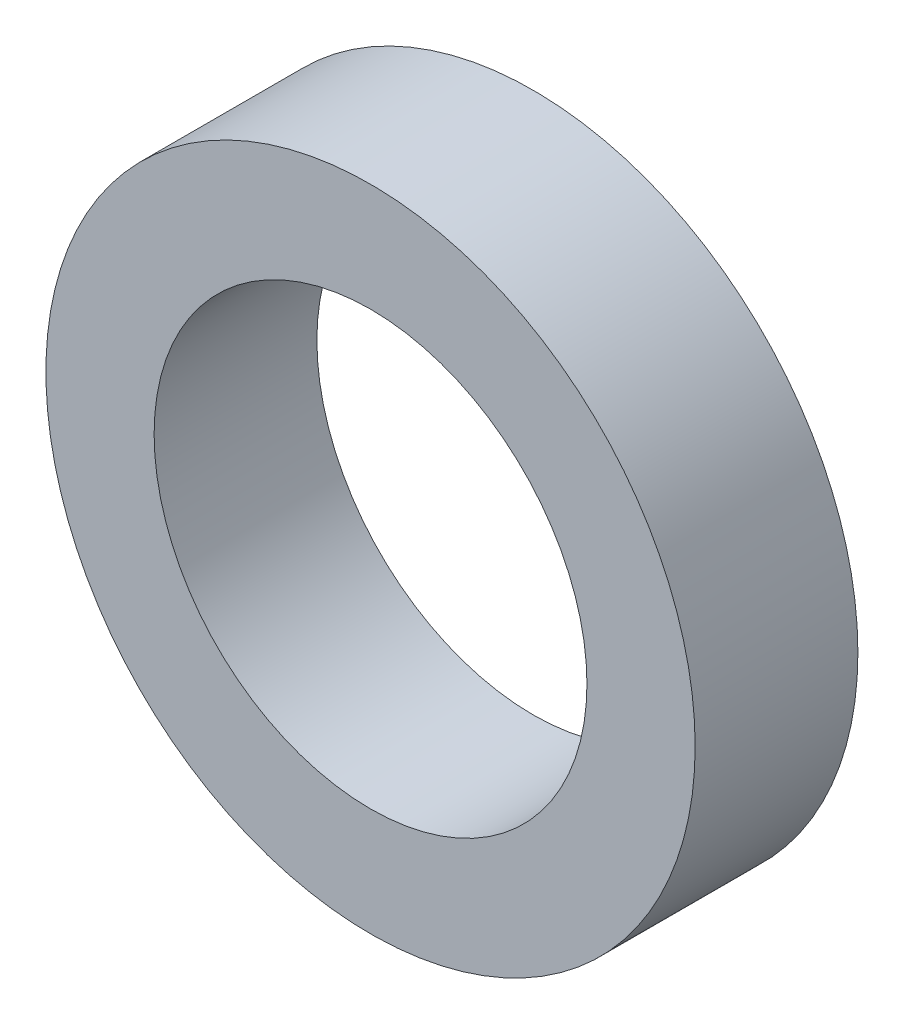
ISO-10303-21;
HEADER;
FILE_DESCRIPTION(('STEP AP214'),'2;1');
FILE_NAME('part.step','',(''),(''),'','','');
FILE_SCHEMA(('AUTOMOTIVE_DESIGN { 1 0 10303 214 1 1 1 1 }'));
ENDSEC;
DATA;
#1=APPLICATION_CONTEXT('core data for automotive mechanical design processes');
#2=APPLICATION_PROTOCOL_DEFINITION('international standard','automotive_design',2000,#1);
#3=PRODUCT_CONTEXT('',#1,'mechanical');
#4=PRODUCT('Part','Part','',(#3));
#5=PRODUCT_RELATED_PRODUCT_CATEGORY('part','',(#4));
#6=PRODUCT_DEFINITION_FORMATION('','',#4);
#7=PRODUCT_DEFINITION_CONTEXT('part definition',#1,'design');
#8=PRODUCT_DEFINITION('design','',#6,#7);
#9=PRODUCT_DEFINITION_SHAPE('','',#8);
#10=(LENGTH_UNIT() NAMED_UNIT(*) SI_UNIT(.MILLI.,.METRE.));
#11=(NAMED_UNIT(*) PLANE_ANGLE_UNIT() SI_UNIT($,.RADIAN.));
#12=(NAMED_UNIT(*) SI_UNIT($,.STERADIAN.) SOLID_ANGLE_UNIT());
#13=UNCERTAINTY_MEASURE_WITH_UNIT(LENGTH_MEASURE(1.E-05),#10,'distance_accuracy_value','');
#14=(GEOMETRIC_REPRESENTATION_CONTEXT(3) GLOBAL_UNCERTAINTY_ASSIGNED_CONTEXT((#13)) GLOBAL_UNIT_ASSIGNED_CONTEXT((#10,
#11,#12)) REPRESENTATION_CONTEXT('',''));
#15=CARTESIAN_POINT('',(0.,0.,0.));
#16=DIRECTION('',(0.,0.,1.));
#17=DIRECTION('',(1.,0.,0.));
#18=AXIS2_PLACEMENT_3D('',#15,#16,#17);
#19=CARTESIAN_POINT('',(6.35000000000001,0.,0.));
#20=DIRECTION('',(0.,0.,1.));
#21=DIRECTION('',(1.,0.,0.));
#22=AXIS2_PLACEMENT_3D('',#19,#20,#21);
#23=PLANE('',#22);
#24=CARTESIAN_POINT('',(0.,0.,0.));
#25=DIRECTION('',(0.,0.,1.));
#26=DIRECTION('',(1.,0.,0.));
#27=AXIS2_PLACEMENT_3D('',#24,#25,#26);
#28=CIRCLE('',#27,6.35);
#29=CARTESIAN_POINT('',(6.35,0.,0.));
#30=VERTEX_POINT('',#29);
#31=EDGE_CURVE('E18',#30,#30,#28,.F.);
#32=ORIENTED_EDGE('',*,*,#31,.T.);
#33=EDGE_LOOP('',(#32));
#34=FACE_BOUND('',#33,.T.);
#35=CARTESIAN_POINT('',(0.,0.,0.));
#36=DIRECTION('',(0.,0.,1.));
#37=DIRECTION('',(1.,0.,0.));
#38=AXIS2_PLACEMENT_3D('',#35,#36,#37);
#39=CIRCLE('',#38,9.525);
#40=CARTESIAN_POINT('',(9.525,0.,0.));
#41=VERTEX_POINT('',#40);
#42=EDGE_CURVE('E27',#41,#41,#39,.F.);
#43=ORIENTED_EDGE('',*,*,#42,.F.);
#44=EDGE_LOOP('',(#43));
#45=FACE_BOUND('',#44,.T.);
#46=ADVANCED_FACE('F15',(#34,#45),#23,.T.);
#47=CARTESIAN_POINT('',(0.,0.,0.));
#48=DIRECTION('',(0.,0.,1.));
#49=DIRECTION('',(1.,0.,0.));
#50=AXIS2_PLACEMENT_3D('',#47,#48,#49);
#51=CYLINDRICAL_SURFACE('',#50,6.35);
#52=ORIENTED_EDGE('',*,*,#31,.F.);
#53=EDGE_LOOP('',(#52));
#54=FACE_BOUND('',#53,.T.);
#55=CARTESIAN_POINT('',(0.,0.,-4.7752));
#56=DIRECTION('',(0.,0.,1.));
#57=DIRECTION('',(1.,0.,0.));
#58=AXIS2_PLACEMENT_3D('',#55,#56,#57);
#59=CIRCLE('',#58,6.35);
#60=CARTESIAN_POINT('',(6.35,0.,-4.7752));
#61=VERTEX_POINT('',#60);
#62=EDGE_CURVE('E22',#61,#61,#59,.T.);
#63=ORIENTED_EDGE('',*,*,#62,.F.);
#64=EDGE_LOOP('',(#63));
#65=FACE_BOUND('',#64,.T.);
#66=ADVANCED_FACE('F37',(#54,#65),#51,.F.);
#67=CARTESIAN_POINT('',(0.,0.,0.));
#68=DIRECTION('',(0.,0.,1.));
#69=DIRECTION('',(1.,0.,0.));
#70=AXIS2_PLACEMENT_3D('',#67,#68,#69);
#71=CYLINDRICAL_SURFACE('',#70,9.525);
#72=CARTESIAN_POINT('',(0.,0.,-4.7752));
#73=DIRECTION('',(0.,0.,1.));
#74=DIRECTION('',(1.,0.,0.));
#75=AXIS2_PLACEMENT_3D('',#72,#73,#74);
#76=CIRCLE('',#75,9.525);
#77=CARTESIAN_POINT('',(9.525,0.,-4.7752));
#78=VERTEX_POINT('',#77);
#79=EDGE_CURVE('E10',#78,#78,#76,.F.);
#80=ORIENTED_EDGE('',*,*,#79,.F.);
#81=EDGE_LOOP('',(#80));
#82=FACE_BOUND('',#81,.T.);
#83=ORIENTED_EDGE('',*,*,#42,.T.);
#84=EDGE_LOOP('',(#83));
#85=FACE_BOUND('',#84,.T.);
#86=ADVANCED_FACE('F40',(#82,#85),#71,.T.);
#87=CARTESIAN_POINT('',(6.35,0.,-4.7752));
#88=DIRECTION('',(0.,0.,-1.));
#89=DIRECTION('',(-1.,0.,0.));
#90=AXIS2_PLACEMENT_3D('',#87,#88,#89);
#91=PLANE('',#90);
#92=ORIENTED_EDGE('',*,*,#79,.T.);
#93=EDGE_LOOP('',(#92));
#94=FACE_BOUND('',#93,.T.);
#95=ORIENTED_EDGE('',*,*,#62,.T.);
#96=EDGE_LOOP('',(#95));
#97=FACE_BOUND('',#96,.T.);
#98=ADVANCED_FACE('F43',(#94,#97),#91,.T.);
#99=CLOSED_SHELL('',(#46,#66,#86,#98));
#100=MANIFOLD_SOLID_BREP('B1',#99);
#101=ADVANCED_BREP_SHAPE_REPRESENTATION('',(#18,#100),#14);
#102=SHAPE_DEFINITION_REPRESENTATION(#9,#101);
ENDSEC;
END-ISO-10303-21;
